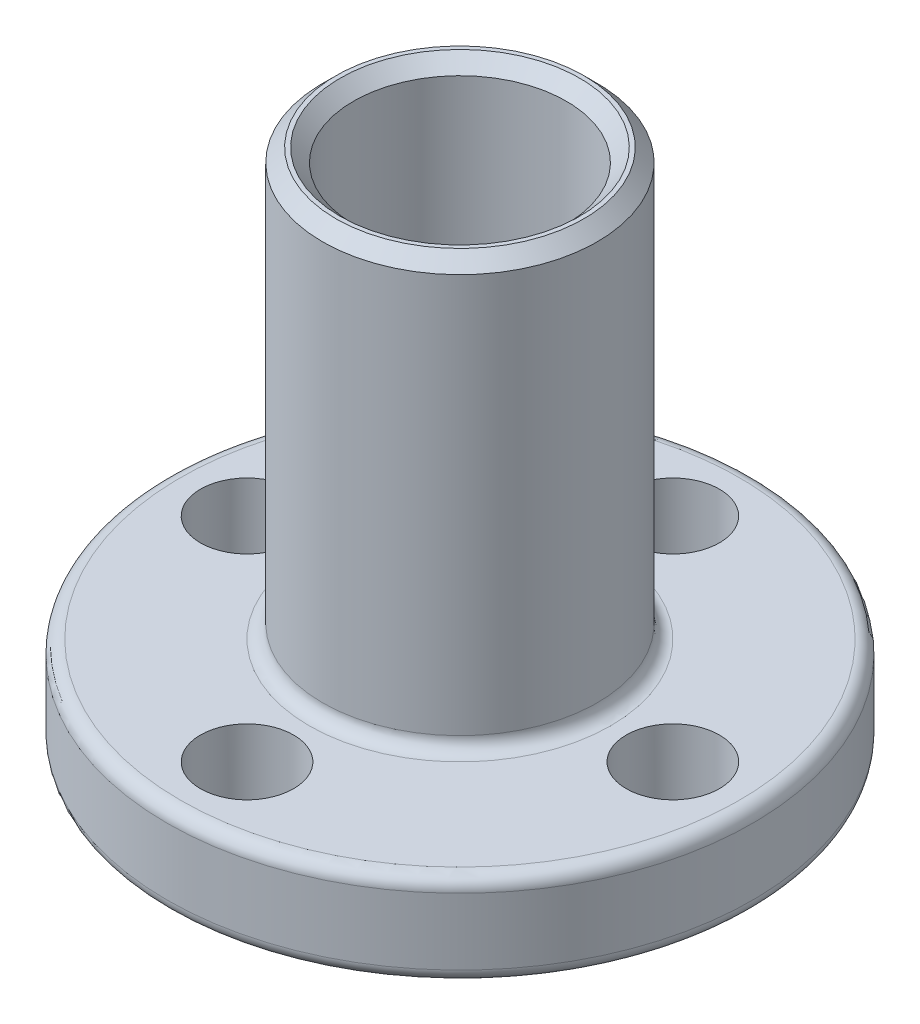
ISO-10303-21;
HEADER;
FILE_DESCRIPTION(('STEP AP214'),'2;1');
FILE_NAME('part.step','',(''),(''),'','','');
FILE_SCHEMA(('AUTOMOTIVE_DESIGN { 1 0 10303 214 1 1 1 1 }'));
ENDSEC;
DATA;
#1=APPLICATION_CONTEXT('core data for automotive mechanical design processes');
#2=APPLICATION_PROTOCOL_DEFINITION('international standard','automotive_design',2000,#1);
#3=PRODUCT_CONTEXT('',#1,'mechanical');
#4=PRODUCT('Part','Part','',(#3));
#5=PRODUCT_RELATED_PRODUCT_CATEGORY('part','',(#4));
#6=PRODUCT_DEFINITION_FORMATION('','',#4);
#7=PRODUCT_DEFINITION_CONTEXT('part definition',#1,'design');
#8=PRODUCT_DEFINITION('design','',#6,#7);
#9=PRODUCT_DEFINITION_SHAPE('','',#8);
#10=(LENGTH_UNIT() NAMED_UNIT(*) SI_UNIT(.MILLI.,.METRE.));
#11=(NAMED_UNIT(*) PLANE_ANGLE_UNIT() SI_UNIT($,.RADIAN.));
#12=(NAMED_UNIT(*) SI_UNIT($,.STERADIAN.) SOLID_ANGLE_UNIT());
#13=UNCERTAINTY_MEASURE_WITH_UNIT(LENGTH_MEASURE(1.E-05),#10,'distance_accuracy_value','');
#14=(GEOMETRIC_REPRESENTATION_CONTEXT(3) GLOBAL_UNCERTAINTY_ASSIGNED_CONTEXT((#13)) GLOBAL_UNIT_ASSIGNED_CONTEXT((#10,
#11,#12)) REPRESENTATION_CONTEXT('',''));
#15=CARTESIAN_POINT('',(0.,0.,0.));
#16=DIRECTION('',(0.,0.,1.));
#17=DIRECTION('',(1.,0.,0.));
#18=AXIS2_PLACEMENT_3D('',#15,#16,#17);
#19=CARTESIAN_POINT('',(0.,1.5,0.));
#20=DIRECTION('',(0.,-1.,0.));
#21=DIRECTION('',(0.,0.,-1.));
#22=AXIS2_PLACEMENT_3D('',#19,#20,#21);
#23=CYLINDRICAL_SURFACE('',#22,5.16);
#24=CARTESIAN_POINT('',(0.,0.499999999999999,0.));
#25=DIRECTION('',(0.,1.,0.));
#26=DIRECTION('',(0.,0.,1.));
#27=AXIS2_PLACEMENT_3D('',#24,#25,#26);
#28=CIRCLE('',#27,5.16);
#29=CARTESIAN_POINT('',(0.,0.499999999999999,5.16));
#30=VERTEX_POINT('',#29);
#31=EDGE_CURVE('E64',#30,#30,#28,.T.);
#32=ORIENTED_EDGE('',*,*,#31,.T.);
#33=EDGE_LOOP('',(#32));
#34=FACE_BOUND('',#33,.T.);
#35=CARTESIAN_POINT('',(0.,1.,0.));
#36=DIRECTION('',(0.,1.,0.));
#37=DIRECTION('',(0.,0.,1.));
#38=AXIS2_PLACEMENT_3D('',#35,#36,#37);
#39=CIRCLE('',#38,5.16);
#40=CARTESIAN_POINT('',(0.,1.,5.16));
#41=VERTEX_POINT('',#40);
#42=EDGE_CURVE('E82',#41,#41,#39,.F.);
#43=ORIENTED_EDGE('',*,*,#42,.T.);
#44=EDGE_LOOP('',(#43));
#45=FACE_BOUND('',#44,.T.);
#46=ADVANCED_FACE('F34',(#34,#45),#23,.T.);
#47=CARTESIAN_POINT('',(0.,0.,0.));
#48=DIRECTION('',(0.,1.,0.));
#49=DIRECTION('',(0.,0.,1.));
#50=AXIS2_PLACEMENT_3D('',#47,#48,#49);
#51=PLANE('',#50);
#52=CARTESIAN_POINT('',(0.,0.,0.));
#53=DIRECTION('',(0.,1.,0.));
#54=DIRECTION('',(0.,0.,1.));
#55=AXIS2_PLACEMENT_3D('',#52,#53,#54);
#56=CIRCLE('',#55,4.66);
#57=CARTESIAN_POINT('',(0.,0.,4.66));
#58=VERTEX_POINT('',#57);
#59=EDGE_CURVE('E58',#58,#58,#56,.F.);
#60=ORIENTED_EDGE('',*,*,#59,.T.);
#61=EDGE_LOOP('',(#60));
#62=FACE_BOUND('',#61,.T.);
#63=CARTESIAN_POINT('',(0.,0.,0.));
#64=DIRECTION('',(0.,1.,0.));
#65=DIRECTION('',(0.,0.,1.));
#66=AXIS2_PLACEMENT_3D('',#63,#64,#65);
#67=CIRCLE('',#66,4.50000000000001);
#68=CARTESIAN_POINT('',(0.,0.,4.50000000000001));
#69=VERTEX_POINT('',#68);
#70=EDGE_CURVE('E61',#69,#69,#67,.T.);
#71=ORIENTED_EDGE('',*,*,#70,.T.);
#72=EDGE_LOOP('',(#71));
#73=FACE_BOUND('',#72,.T.);
#74=ADVANCED_FACE('F153',(#62,#73),#51,.F.);
#75=CARTESIAN_POINT('',(0.,5.,0.));
#76=DIRECTION('',(0.,-1.,0.));
#77=DIRECTION('',(0.,0.,-1.));
#78=AXIS2_PLACEMENT_3D('',#75,#76,#77);
#79=CYLINDRICAL_SURFACE('',#78,11.);
#80=CARTESIAN_POINT('',(0.,4.5,0.));
#81=DIRECTION('',(0.,1.,0.));
#82=DIRECTION('',(0.,0.,1.));
#83=AXIS2_PLACEMENT_3D('',#80,#81,#82);
#84=CIRCLE('',#83,11.);
#85=CARTESIAN_POINT('',(0.,4.5,11.));
#86=VERTEX_POINT('',#85);
#87=EDGE_CURVE('E70',#86,#86,#84,.F.);
#88=ORIENTED_EDGE('',*,*,#87,.T.);
#89=EDGE_LOOP('',(#88));
#90=FACE_BOUND('',#89,.T.);
#91=CARTESIAN_POINT('',(0.,2.,0.));
#92=DIRECTION('',(0.,1.,0.));
#93=DIRECTION('',(0.,0.,1.));
#94=AXIS2_PLACEMENT_3D('',#91,#92,#93);
#95=CIRCLE('',#94,11.);
#96=CARTESIAN_POINT('',(0.,2.,11.));
#97=VERTEX_POINT('',#96);
#98=EDGE_CURVE('E73',#97,#97,#95,.T.);
#99=ORIENTED_EDGE('',*,*,#98,.T.);
#100=EDGE_LOOP('',(#99));
#101=FACE_BOUND('',#100,.T.);
#102=ADVANCED_FACE('F123',(#90,#101),#79,.T.);
#103=CARTESIAN_POINT('',(0.,5.,0.));
#104=DIRECTION('',(0.,1.,0.));
#105=DIRECTION('',(0.,0.,1.));
#106=AXIS2_PLACEMENT_3D('',#103,#104,#105);
#107=PLANE('',#106);
#108=CARTESIAN_POINT('',(0.,5.,0.));
#109=DIRECTION('',(0.,1.,0.));
#110=DIRECTION('',(0.,0.,1.));
#111=AXIS2_PLACEMENT_3D('',#108,#109,#110);
#112=CIRCLE('',#111,10.5);
#113=CARTESIAN_POINT('',(0.,5.,10.5));
#114=VERTEX_POINT('',#113);
#115=EDGE_CURVE('E76',#114,#114,#112,.T.);
#116=ORIENTED_EDGE('',*,*,#115,.T.);
#117=EDGE_LOOP('',(#116));
#118=FACE_BOUND('',#117,.T.);
#119=CARTESIAN_POINT('',(0.,5.,0.));
#120=DIRECTION('',(0.,1.,0.));
#121=DIRECTION('',(0.,0.,1.));
#122=AXIS2_PLACEMENT_3D('',#119,#120,#121);
#123=CIRCLE('',#122,5.66);
#124=CARTESIAN_POINT('',(0.,5.,5.66));
#125=VERTEX_POINT('',#124);
#126=EDGE_CURVE('E79',#125,#125,#123,.F.);
#127=ORIENTED_EDGE('',*,*,#126,.T.);
#128=EDGE_LOOP('',(#127));
#129=FACE_BOUND('',#128,.T.);
#130=CARTESIAN_POINT('',(-8.,5.,0.));
#131=DIRECTION('',(0.,1.,0.));
#132=DIRECTION('',(1.,0.,0.));
#133=AXIS2_PLACEMENT_3D('',#130,#131,#132);
#134=CIRCLE('',#133,1.75);
#135=CARTESIAN_POINT('',(-6.25,5.,0.));
#136=VERTEX_POINT('',#135);
#137=EDGE_CURVE('E102',#136,#136,#134,.T.);
#138=ORIENTED_EDGE('',*,*,#137,.F.);
#139=EDGE_LOOP('',(#138));
#140=FACE_BOUND('',#139,.T.);
#141=CARTESIAN_POINT('',(0.,5.,8.));
#142=DIRECTION('',(0.,1.,0.));
#143=DIRECTION('',(0.,0.,-1.));
#144=AXIS2_PLACEMENT_3D('',#141,#142,#143);
#145=CIRCLE('',#144,1.75);
#146=CARTESIAN_POINT('',(0.,5.,6.25));
#147=VERTEX_POINT('',#146);
#148=EDGE_CURVE('E110',#147,#147,#145,.T.);
#149=ORIENTED_EDGE('',*,*,#148,.F.);
#150=EDGE_LOOP('',(#149));
#151=FACE_BOUND('',#150,.T.);
#152=CARTESIAN_POINT('',(8.,5.,0.));
#153=DIRECTION('',(0.,1.,0.));
#154=DIRECTION('',(-1.,0.,0.));
#155=AXIS2_PLACEMENT_3D('',#152,#153,#154);
#156=CIRCLE('',#155,1.75);
#157=CARTESIAN_POINT('',(6.25,5.,0.));
#158=VERTEX_POINT('',#157);
#159=EDGE_CURVE('E107',#158,#158,#156,.T.);
#160=ORIENTED_EDGE('',*,*,#159,.F.);
#161=EDGE_LOOP('',(#160));
#162=FACE_BOUND('',#161,.T.);
#163=CARTESIAN_POINT('',(0.,5.,-8.));
#164=DIRECTION('',(0.,1.,0.));
#165=DIRECTION('',(0.,0.,1.));
#166=AXIS2_PLACEMENT_3D('',#163,#164,#165);
#167=CIRCLE('',#166,1.75);
#168=CARTESIAN_POINT('',(0.,5.,-6.25));
#169=VERTEX_POINT('',#168);
#170=EDGE_CURVE('E95',#169,#169,#167,.T.);
#171=ORIENTED_EDGE('',*,*,#170,.F.);
#172=EDGE_LOOP('',(#171));
#173=FACE_BOUND('',#172,.T.);
#174=ADVANCED_FACE('F119',(#118,#129,#140,#151,#162,#173),#107,.T.);
#175=CARTESIAN_POINT('',(0.,1.5,0.));
#176=DIRECTION('',(0.,1.,0.));
#177=DIRECTION('',(0.,0.,1.));
#178=AXIS2_PLACEMENT_3D('',#175,#176,#177);
#179=PLANE('',#178);
#180=CARTESIAN_POINT('',(0.,1.5,0.));
#181=DIRECTION('',(0.,1.,0.));
#182=DIRECTION('',(0.,0.,1.));
#183=AXIS2_PLACEMENT_3D('',#180,#181,#182);
#184=CIRCLE('',#183,5.66);
#185=CARTESIAN_POINT('',(0.,1.5,5.66));
#186=VERTEX_POINT('',#185);
#187=EDGE_CURVE('E85',#186,#186,#184,.T.);
#188=ORIENTED_EDGE('',*,*,#187,.T.);
#189=EDGE_LOOP('',(#188));
#190=FACE_BOUND('',#189,.T.);
#191=CARTESIAN_POINT('',(0.,1.5,0.));
#192=DIRECTION('',(0.,1.,0.));
#193=DIRECTION('',(0.,0.,1.));
#194=AXIS2_PLACEMENT_3D('',#191,#192,#193);
#195=CIRCLE('',#194,10.5);
#196=CARTESIAN_POINT('',(0.,1.5,10.5));
#197=VERTEX_POINT('',#196);
#198=EDGE_CURVE('E88',#197,#197,#195,.F.);
#199=ORIENTED_EDGE('',*,*,#198,.T.);
#200=EDGE_LOOP('',(#199));
#201=FACE_BOUND('',#200,.T.);
#202=CARTESIAN_POINT('',(-8.,1.5,0.));
#203=DIRECTION('',(0.,1.,0.));
#204=DIRECTION('',(0.,0.,1.));
#205=AXIS2_PLACEMENT_3D('',#202,#203,#204);
#206=CIRCLE('',#205,1.75);
#207=CARTESIAN_POINT('',(-8.,1.5,1.75000000000003));
#208=VERTEX_POINT('',#207);
#209=EDGE_CURVE('E92',#208,#208,#206,.T.);
#210=ORIENTED_EDGE('',*,*,#209,.T.);
#211=EDGE_LOOP('',(#210));
#212=FACE_BOUND('',#211,.T.);
#213=CARTESIAN_POINT('',(0.,1.5,8.));
#214=DIRECTION('',(0.,1.,0.));
#215=DIRECTION('',(0.,0.,1.));
#216=AXIS2_PLACEMENT_3D('',#213,#214,#215);
#217=CIRCLE('',#216,1.75);
#218=CARTESIAN_POINT('',(0.,1.5,9.75));
#219=VERTEX_POINT('',#218);
#220=EDGE_CURVE('E96',#219,#219,#217,.T.);
#221=ORIENTED_EDGE('',*,*,#220,.T.);
#222=EDGE_LOOP('',(#221));
#223=FACE_BOUND('',#222,.T.);
#224=CARTESIAN_POINT('',(8.,1.5,0.));
#225=DIRECTION('',(0.,1.,0.));
#226=DIRECTION('',(0.,0.,1.));
#227=AXIS2_PLACEMENT_3D('',#224,#225,#226);
#228=CIRCLE('',#227,1.75);
#229=CARTESIAN_POINT('',(8.,1.5,1.74999999999992));
#230=VERTEX_POINT('',#229);
#231=EDGE_CURVE('E99',#230,#230,#228,.T.);
#232=ORIENTED_EDGE('',*,*,#231,.T.);
#233=EDGE_LOOP('',(#232));
#234=FACE_BOUND('',#233,.T.);
#235=CARTESIAN_POINT('',(0.,1.5,-8.));
#236=DIRECTION('',(0.,1.,0.));
#237=DIRECTION('',(0.,0.,1.));
#238=AXIS2_PLACEMENT_3D('',#235,#236,#237);
#239=CIRCLE('',#238,1.75);
#240=CARTESIAN_POINT('',(0.,1.5,-6.25));
#241=VERTEX_POINT('',#240);
#242=EDGE_CURVE('E91',#241,#241,#239,.T.);
#243=ORIENTED_EDGE('',*,*,#242,.T.);
#244=EDGE_LOOP('',(#243));
#245=FACE_BOUND('',#244,.T.);
#246=ADVANCED_FACE('F122',(#190,#201,#212,#223,#234,#245),#179,.F.);
#247=CARTESIAN_POINT('',(0.,21.,0.));
#248=DIRECTION('',(0.,-1.,0.));
#249=DIRECTION('',(0.,0.,-1.));
#250=AXIS2_PLACEMENT_3D('',#247,#248,#249);
#251=CYLINDRICAL_SURFACE('',#250,5.16);
#252=CARTESIAN_POINT('',(0.,20.5,0.));
#253=DIRECTION('',(0.,1.,0.));
#254=DIRECTION('',(0.,0.,1.));
#255=AXIS2_PLACEMENT_3D('',#252,#253,#254);
#256=CIRCLE('',#255,5.16);
#257=CARTESIAN_POINT('',(0.,20.5,5.16));
#258=VERTEX_POINT('',#257);
#259=EDGE_CURVE('E46',#258,#258,#256,.F.);
#260=ORIENTED_EDGE('',*,*,#259,.T.);
#261=EDGE_LOOP('',(#260));
#262=FACE_BOUND('',#261,.T.);
#263=CARTESIAN_POINT('',(0.,5.5,0.));
#264=DIRECTION('',(0.,1.,0.));
#265=DIRECTION('',(0.,0.,1.));
#266=AXIS2_PLACEMENT_3D('',#263,#264,#265);
#267=CIRCLE('',#266,5.16);
#268=CARTESIAN_POINT('',(0.,5.5,5.16));
#269=VERTEX_POINT('',#268);
#270=EDGE_CURVE('E67',#269,#269,#267,.T.);
#271=ORIENTED_EDGE('',*,*,#270,.T.);
#272=EDGE_LOOP('',(#271));
#273=FACE_BOUND('',#272,.T.);
#274=ADVANCED_FACE('F141',(#262,#273),#251,.T.);
#275=CARTESIAN_POINT('',(0.,21.,0.));
#276=DIRECTION('',(0.,1.,0.));
#277=DIRECTION('',(0.,0.,1.));
#278=AXIS2_PLACEMENT_3D('',#275,#276,#277);
#279=PLANE('',#278);
#280=CARTESIAN_POINT('',(0.,21.,0.));
#281=DIRECTION('',(0.,1.,0.));
#282=DIRECTION('',(0.,0.,1.));
#283=AXIS2_PLACEMENT_3D('',#280,#281,#282);
#284=CIRCLE('',#283,4.65999999999999);
#285=CARTESIAN_POINT('',(0.,21.,4.65999999999999));
#286=VERTEX_POINT('',#285);
#287=EDGE_CURVE('E50',#286,#286,#284,.T.);
#288=ORIENTED_EDGE('',*,*,#287,.T.);
#289=EDGE_LOOP('',(#288));
#290=FACE_BOUND('',#289,.T.);
#291=CARTESIAN_POINT('',(0.,21.,0.));
#292=DIRECTION('',(0.,1.,0.));
#293=DIRECTION('',(0.,0.,1.));
#294=AXIS2_PLACEMENT_3D('',#291,#292,#293);
#295=CIRCLE('',#294,4.5);
#296=CARTESIAN_POINT('',(0.,21.,4.5));
#297=VERTEX_POINT('',#296);
#298=EDGE_CURVE('E55',#297,#297,#295,.F.);
#299=ORIENTED_EDGE('',*,*,#298,.T.);
#300=EDGE_LOOP('',(#299));
#301=FACE_BOUND('',#300,.T.);
#302=ADVANCED_FACE('F147',(#290,#301),#279,.T.);
#303=CARTESIAN_POINT('',(0.,-5.,0.));
#304=DIRECTION('',(0.,1.,0.));
#305=DIRECTION('',(0.,0.,1.));
#306=AXIS2_PLACEMENT_3D('',#303,#304,#305);
#307=CYLINDRICAL_SURFACE('',#306,4.);
#308=CARTESIAN_POINT('',(0.,20.5,0.));
#309=DIRECTION('',(0.,1.,0.));
#310=DIRECTION('',(0.,0.,1.));
#311=AXIS2_PLACEMENT_3D('',#308,#309,#310);
#312=CIRCLE('',#311,4.);
#313=CARTESIAN_POINT('',(0.,20.5,4.));
#314=VERTEX_POINT('',#313);
#315=EDGE_CURVE('E10',#314,#314,#312,.T.);
#316=ORIENTED_EDGE('',*,*,#315,.T.);
#317=EDGE_LOOP('',(#316));
#318=FACE_BOUND('',#317,.T.);
#319=CARTESIAN_POINT('',(0.,0.500000000000007,0.));
#320=DIRECTION('',(0.,1.,0.));
#321=DIRECTION('',(0.,0.,1.));
#322=AXIS2_PLACEMENT_3D('',#319,#320,#321);
#323=CIRCLE('',#322,4.);
#324=CARTESIAN_POINT('',(0.,0.500000000000007,4.));
#325=VERTEX_POINT('',#324);
#326=EDGE_CURVE('E42',#325,#325,#323,.F.);
#327=ORIENTED_EDGE('',*,*,#326,.T.);
#328=EDGE_LOOP('',(#327));
#329=FACE_BOUND('',#328,.T.);
#330=ADVANCED_FACE('F136',(#318,#329),#307,.F.);
#331=CARTESIAN_POINT('',(0.,-21.,-8.));
#332=DIRECTION('',(0.,1.,0.));
#333=DIRECTION('',(0.,0.,1.));
#334=AXIS2_PLACEMENT_3D('',#331,#332,#333);
#335=CYLINDRICAL_SURFACE('',#334,1.75);
#336=ORIENTED_EDGE('',*,*,#170,.T.);
#337=EDGE_LOOP('',(#336));
#338=FACE_BOUND('',#337,.T.);
#339=ORIENTED_EDGE('',*,*,#242,.F.);
#340=EDGE_LOOP('',(#339));
#341=FACE_BOUND('',#340,.T.);
#342=ADVANCED_FACE('F132',(#338,#341),#335,.F.);
#343=CARTESIAN_POINT('',(8.,-21.,0.));
#344=DIRECTION('',(0.,1.,0.));
#345=DIRECTION('',(0.,0.,1.));
#346=AXIS2_PLACEMENT_3D('',#343,#344,#345);
#347=CYLINDRICAL_SURFACE('',#346,1.75);
#348=ORIENTED_EDGE('',*,*,#159,.T.);
#349=EDGE_LOOP('',(#348));
#350=FACE_BOUND('',#349,.T.);
#351=ORIENTED_EDGE('',*,*,#231,.F.);
#352=EDGE_LOOP('',(#351));
#353=FACE_BOUND('',#352,.T.);
#354=ADVANCED_FACE('F135',(#350,#353),#347,.F.);
#355=CARTESIAN_POINT('',(0.,-21.,8.));
#356=DIRECTION('',(0.,1.,0.));
#357=DIRECTION('',(0.,0.,1.));
#358=AXIS2_PLACEMENT_3D('',#355,#356,#357);
#359=CYLINDRICAL_SURFACE('',#358,1.75);
#360=ORIENTED_EDGE('',*,*,#148,.T.);
#361=EDGE_LOOP('',(#360));
#362=FACE_BOUND('',#361,.T.);
#363=ORIENTED_EDGE('',*,*,#220,.F.);
#364=EDGE_LOOP('',(#363));
#365=FACE_BOUND('',#364,.T.);
#366=ADVANCED_FACE('F215',(#362,#365),#359,.F.);
#367=CARTESIAN_POINT('',(-8.,-21.,0.));
#368=DIRECTION('',(0.,1.,0.));
#369=DIRECTION('',(0.,0.,1.));
#370=AXIS2_PLACEMENT_3D('',#367,#368,#369);
#371=CYLINDRICAL_SURFACE('',#370,1.75);
#372=ORIENTED_EDGE('',*,*,#137,.T.);
#373=EDGE_LOOP('',(#372));
#374=FACE_BOUND('',#373,.T.);
#375=ORIENTED_EDGE('',*,*,#209,.F.);
#376=EDGE_LOOP('',(#375));
#377=FACE_BOUND('',#376,.T.);
#378=ADVANCED_FACE('F116',(#374,#377),#371,.F.);
#379=CARTESIAN_POINT('',(0.,1.,0.));
#380=DIRECTION('',(0.,1.,0.));
#381=DIRECTION('',(0.,0.,1.));
#382=AXIS2_PLACEMENT_3D('',#379,#380,#381);
#383=TOROIDAL_SURFACE('',#382,5.66,0.5);
#384=ORIENTED_EDGE('',*,*,#42,.F.);
#385=EDGE_LOOP('',(#384));
#386=FACE_BOUND('',#385,.T.);
#387=ORIENTED_EDGE('',*,*,#187,.F.);
#388=EDGE_LOOP('',(#387));
#389=FACE_BOUND('',#388,.T.);
#390=ADVANCED_FACE('F163',(#386,#389),#383,.F.);
#391=CARTESIAN_POINT('',(0.,4.5,0.));
#392=DIRECTION('',(0.,1.,0.));
#393=DIRECTION('',(0.,0.,1.));
#394=AXIS2_PLACEMENT_3D('',#391,#392,#393);
#395=TOROIDAL_SURFACE('',#394,10.5,0.5);
#396=ORIENTED_EDGE('',*,*,#87,.F.);
#397=EDGE_LOOP('',(#396));
#398=FACE_BOUND('',#397,.T.);
#399=ORIENTED_EDGE('',*,*,#115,.F.);
#400=EDGE_LOOP('',(#399));
#401=FACE_BOUND('',#400,.T.);
#402=ADVANCED_FACE('F166',(#398,#401),#395,.T.);
#403=CARTESIAN_POINT('',(0.,2.,0.));
#404=DIRECTION('',(0.,1.,0.));
#405=DIRECTION('',(0.,0.,1.));
#406=AXIS2_PLACEMENT_3D('',#403,#404,#405);
#407=TOROIDAL_SURFACE('',#406,10.5,0.5);
#408=ORIENTED_EDGE('',*,*,#198,.F.);
#409=EDGE_LOOP('',(#408));
#410=FACE_BOUND('',#409,.T.);
#411=ORIENTED_EDGE('',*,*,#98,.F.);
#412=EDGE_LOOP('',(#411));
#413=FACE_BOUND('',#412,.T.);
#414=ADVANCED_FACE('F170',(#410,#413),#407,.T.);
#415=CARTESIAN_POINT('',(0.,5.5,0.));
#416=DIRECTION('',(0.,1.,0.));
#417=DIRECTION('',(0.,0.,1.));
#418=AXIS2_PLACEMENT_3D('',#415,#416,#417);
#419=TOROIDAL_SURFACE('',#418,5.66,0.5);
#420=ORIENTED_EDGE('',*,*,#126,.F.);
#421=EDGE_LOOP('',(#420));
#422=FACE_BOUND('',#421,.T.);
#423=ORIENTED_EDGE('',*,*,#270,.F.);
#424=EDGE_LOOP('',(#423));
#425=FACE_BOUND('',#424,.T.);
#426=ADVANCED_FACE('F174',(#422,#425),#419,.F.);
#427=CARTESIAN_POINT('',(0.,0.499999999999999,0.));
#428=DIRECTION('',(0.,1.,0.));
#429=DIRECTION('',(0.,0.,1.));
#430=AXIS2_PLACEMENT_3D('',#427,#428,#429);
#431=CONICAL_SURFACE('',#430,5.16,0.785398163397453);
#432=ORIENTED_EDGE('',*,*,#59,.F.);
#433=EDGE_LOOP('',(#432));
#434=FACE_BOUND('',#433,.T.);
#435=ORIENTED_EDGE('',*,*,#31,.F.);
#436=EDGE_LOOP('',(#435));
#437=FACE_BOUND('',#436,.T.);
#438=ADVANCED_FACE('F178',(#434,#437),#431,.T.);
#439=CARTESIAN_POINT('',(0.,21.,0.));
#440=DIRECTION('',(0.,-1.,0.));
#441=DIRECTION('',(0.,0.,-1.));
#442=AXIS2_PLACEMENT_3D('',#439,#440,#441);
#443=CONICAL_SURFACE('',#442,4.65999999999999,0.785398163397447);
#444=ORIENTED_EDGE('',*,*,#259,.F.);
#445=EDGE_LOOP('',(#444));
#446=FACE_BOUND('',#445,.T.);
#447=ORIENTED_EDGE('',*,*,#287,.F.);
#448=EDGE_LOOP('',(#447));
#449=FACE_BOUND('',#448,.T.);
#450=ADVANCED_FACE('F186',(#446,#449),#443,.T.);
#451=CARTESIAN_POINT('',(0.,20.5,0.));
#452=DIRECTION('',(0.,1.,0.));
#453=DIRECTION('',(0.,0.,1.));
#454=AXIS2_PLACEMENT_3D('',#451,#452,#453);
#455=CONICAL_SURFACE('',#454,4.,0.785398163397455);
#456=ORIENTED_EDGE('',*,*,#298,.F.);
#457=EDGE_LOOP('',(#456));
#458=FACE_BOUND('',#457,.T.);
#459=ORIENTED_EDGE('',*,*,#315,.F.);
#460=EDGE_LOOP('',(#459));
#461=FACE_BOUND('',#460,.T.);
#462=ADVANCED_FACE('F192',(#458,#461),#455,.F.);
#463=CARTESIAN_POINT('',(0.,0.,0.));
#464=DIRECTION('',(0.,-1.,0.));
#465=DIRECTION('',(0.,0.,-1.));
#466=AXIS2_PLACEMENT_3D('',#463,#464,#465);
#467=CONICAL_SURFACE('',#466,4.50000000000001,0.785398163397448);
#468=ORIENTED_EDGE('',*,*,#326,.F.);
#469=EDGE_LOOP('',(#468));
#470=FACE_BOUND('',#469,.T.);
#471=ORIENTED_EDGE('',*,*,#70,.F.);
#472=EDGE_LOOP('',(#471));
#473=FACE_BOUND('',#472,.T.);
#474=ADVANCED_FACE('F37',(#470,#473),#467,.F.);
#475=CLOSED_SHELL('',(#46,#74,#102,#174,#246,#274,#302,#330,#342,#354,#366,#378,#390,#402,#414,
#426,#438,#450,#462,#474));
#476=MANIFOLD_SOLID_BREP('B2',#475);
#477=ADVANCED_BREP_SHAPE_REPRESENTATION('',(#18,#476),#14);
#478=SHAPE_DEFINITION_REPRESENTATION(#9,#477);
ENDSEC;
END-ISO-10303-21;
